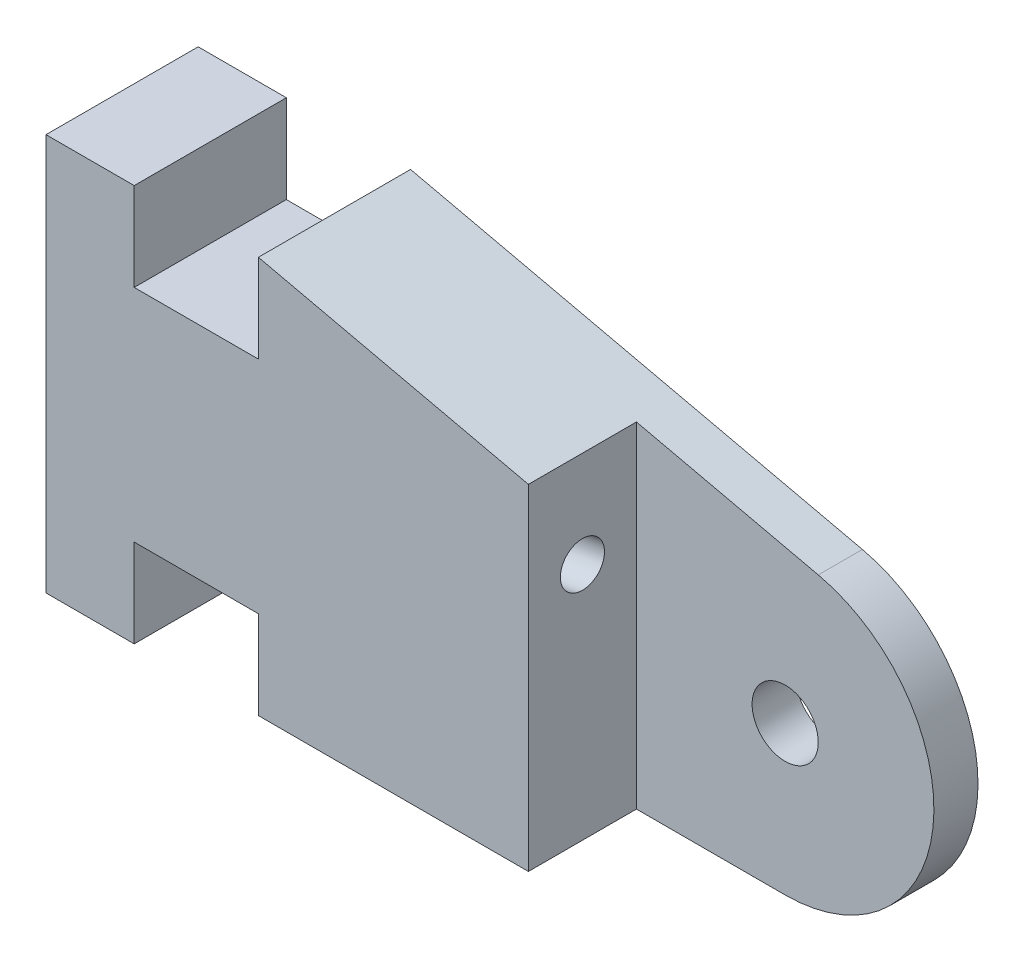
ISO-10303-21;
HEADER;
FILE_DESCRIPTION(('STEP AP214'),'2;1');
FILE_NAME('part.step','',(''),(''),'','','');
FILE_SCHEMA(('AUTOMOTIVE_DESIGN { 1 0 10303 214 1 1 1 1 }'));
ENDSEC;
DATA;
#1=APPLICATION_CONTEXT('core data for automotive mechanical design processes');
#2=APPLICATION_PROTOCOL_DEFINITION('international standard','automotive_design',2000,#1);
#3=PRODUCT_CONTEXT('',#1,'mechanical');
#4=PRODUCT('Part','Part','',(#3));
#5=PRODUCT_RELATED_PRODUCT_CATEGORY('part','',(#4));
#6=PRODUCT_DEFINITION_FORMATION('','',#4);
#7=PRODUCT_DEFINITION_CONTEXT('part definition',#1,'design');
#8=PRODUCT_DEFINITION('design','',#6,#7);
#9=PRODUCT_DEFINITION_SHAPE('','',#8);
#10=(LENGTH_UNIT() NAMED_UNIT(*) SI_UNIT(.MILLI.,.METRE.));
#11=(NAMED_UNIT(*) PLANE_ANGLE_UNIT() SI_UNIT($,.RADIAN.));
#12=(NAMED_UNIT(*) SI_UNIT($,.STERADIAN.) SOLID_ANGLE_UNIT());
#13=UNCERTAINTY_MEASURE_WITH_UNIT(LENGTH_MEASURE(1.E-05),#10,'distance_accuracy_value','');
#14=(GEOMETRIC_REPRESENTATION_CONTEXT(3) GLOBAL_UNCERTAINTY_ASSIGNED_CONTEXT((#13)) GLOBAL_UNIT_ASSIGNED_CONTEXT((#10,
#11,#12)) REPRESENTATION_CONTEXT('',''));
#15=CARTESIAN_POINT('',(0.,0.,0.));
#16=DIRECTION('',(0.,0.,1.));
#17=DIRECTION('',(1.,0.,0.));
#18=AXIS2_PLACEMENT_3D('',#15,#16,#17);
#19=CARTESIAN_POINT('',(21.8764722064192,0.,2.));
#20=DIRECTION('',(-1.,0.,0.));
#21=DIRECTION('',(0.,0.,1.));
#22=AXIS2_PLACEMENT_3D('',#19,#20,#21);
#23=PLANE('',#22);
#24=DIRECTION('',(0.,-1.,0.));
#25=VECTOR('',#24,1.);
#26=CARTESIAN_POINT('',(21.8764722064192,0.,6.9));
#27=LINE('',#26,#25);
#28=CARTESIAN_POINT('',(21.8764722064192,15.2040470613962,6.9));
#29=VERTEX_POINT('',#28);
#30=CARTESIAN_POINT('',(21.8764722064192,0.,6.9));
#31=VERTEX_POINT('',#30);
#32=EDGE_CURVE('E166',#29,#31,#27,.T.);
#33=ORIENTED_EDGE('',*,*,#32,.T.);
#34=DIRECTION('',(0.,0.,1.));
#35=VECTOR('',#34,1.);
#36=CARTESIAN_POINT('',(21.8764722064192,0.,2.));
#37=LINE('',#36,#35);
#38=CARTESIAN_POINT('',(21.8764722064192,0.,2.));
#39=VERTEX_POINT('',#38);
#40=EDGE_CURVE('E179',#39,#31,#37,.T.);
#41=ORIENTED_EDGE('',*,*,#40,.F.);
#42=DIRECTION('',(0.,-1.,0.));
#43=VECTOR('',#42,1.);
#44=CARTESIAN_POINT('',(21.8764722064192,0.,2.));
#45=LINE('',#44,#43);
#46=CARTESIAN_POINT('',(21.8764722064192,15.2040470613962,2.));
#47=VERTEX_POINT('',#46);
#48=EDGE_CURVE('E171',#47,#39,#45,.T.);
#49=ORIENTED_EDGE('',*,*,#48,.F.);
#50=DIRECTION('',(0.,0.,1.));
#51=VECTOR('',#50,1.);
#52=CARTESIAN_POINT('',(21.8764722064192,15.2040470613962,2.));
#53=LINE('',#52,#51);
#54=EDGE_CURVE('E177',#47,#29,#53,.T.);
#55=ORIENTED_EDGE('',*,*,#54,.T.);
#56=EDGE_LOOP('',(#33,#41,#49,#55));
#57=FACE_BOUND('',#56,.T.);
#58=CARTESIAN_POINT('',(21.8764722064192,10.8333931163656,4.45));
#59=DIRECTION('',(-1.,0.,0.));
#60=DIRECTION('',(0.,1.,0.));
#61=AXIS2_PLACEMENT_3D('',#58,#59,#60);
#62=ELLIPSE('',#61,1.01542661188575,1.);
#63=CARTESIAN_POINT('',(21.8764722064192,11.8488197282514,4.45));
#64=VERTEX_POINT('',#63);
#65=EDGE_CURVE('E160',#64,#64,#62,.F.);
#66=ORIENTED_EDGE('',*,*,#65,.F.);
#67=EDGE_LOOP('',(#66));
#68=FACE_BOUND('',#67,.T.);
#69=ADVANCED_FACE('F33',(#57,#68),#23,.F.);
#70=CARTESIAN_POINT('',(7.,8.,4.45));
#71=DIRECTION('',(-1.,0.,0.));
#72=DIRECTION('',(0.,-1.,0.));
#73=AXIS2_PLACEMENT_3D('',#70,#71,#72);
#74=CYLINDRICAL_SURFACE('',#73,1.);
#75=CARTESIAN_POINT('',(0.,8.,4.45));
#76=DIRECTION('',(-1.,0.,0.));
#77=DIRECTION('',(0.,-1.,0.));
#78=AXIS2_PLACEMENT_3D('',#75,#76,#77);
#79=CIRCLE('',#78,1.);
#80=CARTESIAN_POINT('',(0.,7.,4.45));
#81=VERTEX_POINT('',#80);
#82=EDGE_CURVE('E162',#81,#81,#79,.T.);
#83=ORIENTED_EDGE('',*,*,#82,.T.);
#84=EDGE_LOOP('',(#83));
#85=FACE_BOUND('',#84,.T.);
#86=CARTESIAN_POINT('',(5.8075013377449,8.,4.45));
#87=DIRECTION('',(-0.0871557427476594,0.996194698091746,0.));
#88=DIRECTION('',(-0.996194698091746,-0.0871557427476589,0.));
#89=AXIS2_PLACEMENT_3D('',#86,#87,#88);
#90=ELLIPSE('',#89,11.4737132456698,1.);
#91=CARTESIAN_POINT('',(6.821215844022,8.0886885273511,3.45394059157282));
#92=VERTEX_POINT('',#91);
#93=CARTESIAN_POINT('',(7.,8.10433011421715,3.45545727730407));
#94=VERTEX_POINT('',#93);
#95=EDGE_CURVE('E48',#92,#94,#90,.F.);
#96=ORIENTED_EDGE('',*,*,#95,.F.);
#97=CARTESIAN_POINT('',(6.8368540242733,8.,4.45));
#98=DIRECTION('',(-0.984807753012208,-0.173648177666931,0.));
#99=DIRECTION('',(-0.173648177666931,0.984807753012208,0.));
#100=AXIS2_PLACEMENT_3D('',#97,#98,#99);
#101=ELLIPSE('',#100,1.01542661188575,1.);
#102=CARTESIAN_POINT('',(6.821215844022,8.0886885273511,5.44605940842718));
#103=VERTEX_POINT('',#102);
#104=EDGE_CURVE('E11',#92,#103,#101,.F.);
#105=ORIENTED_EDGE('',*,*,#104,.T.);
#106=CARTESIAN_POINT('',(7.,8.10433011421715,5.44454272269593));
#107=VERTEX_POINT('',#106);
#108=EDGE_CURVE('E146',#107,#103,#90,.F.);
#109=ORIENTED_EDGE('',*,*,#108,.F.);
#110=CARTESIAN_POINT('',(7.,8.,4.45));
#111=DIRECTION('',(-1.,0.,0.));
#112=DIRECTION('',(0.,-1.,0.));
#113=AXIS2_PLACEMENT_3D('',#110,#111,#112);
#114=CIRCLE('',#113,1.);
#115=EDGE_CURVE('E159',#94,#107,#114,.T.);
#116=ORIENTED_EDGE('',*,*,#115,.F.);
#117=EDGE_LOOP('',(#96,#105,#109,#116));
#118=FACE_BOUND('',#117,.T.);
#119=ADVANCED_FACE('F158',(#85,#118),#74,.F.);
#120=CARTESIAN_POINT('',(7.,8.,4.45));
#121=DIRECTION('',(-1.,0.,0.));
#122=DIRECTION('',(0.,-1.,0.));
#123=AXIS2_PLACEMENT_3D('',#120,#121,#122);
#124=PLANE('',#123);
#125=ORIENTED_EDGE('',*,*,#115,.T.);
#126=CARTESIAN_POINT('',(7.,8.21026968861433,4.45));
#127=DIRECTION('',(-1.,0.,0.));
#128=DIRECTION('',(0.,1.,0.));
#129=AXIS2_PLACEMENT_3D('',#126,#127,#128);
#130=ELLIPSE('',#129,1.01542661188575,1.);
#131=EDGE_CURVE('E41',#107,#94,#130,.F.);
#132=ORIENTED_EDGE('',*,*,#131,.T.);
#133=EDGE_LOOP('',(#125,#132));
#134=FACE_BOUND('',#133,.T.);
#135=ADVANCED_FACE('F274',(#134),#124,.T.);
#136=CARTESIAN_POINT('',(28.6215163494173,6.74504414299814,6.9));
#137=DIRECTION('',(0.,0.,-1.));
#138=DIRECTION('',(-1.,0.,0.));
#139=AXIS2_PLACEMENT_3D('',#136,#137,#138);
#140=CYLINDRICAL_SURFACE('',#139,6.74504414299814);
#141=CARTESIAN_POINT('',(28.6215163494173,6.74504414299814,2.));
#142=DIRECTION('',(0.,0.,1.));
#143=DIRECTION('',(1.,0.,0.));
#144=AXIS2_PLACEMENT_3D('',#141,#142,#143);
#145=CIRCLE('',#144,6.74504414299814);
#146=CARTESIAN_POINT('',(28.6215163494173,0.,2.));
#147=VERTEX_POINT('',#146);
#148=CARTESIAN_POINT('',(30.1231764912827,13.3208054912624,2.));
#149=VERTEX_POINT('',#148);
#150=EDGE_CURVE('E56',#147,#149,#145,.T.);
#151=ORIENTED_EDGE('',*,*,#150,.F.);
#152=DIRECTION('',(0.,0.,-1.));
#153=VECTOR('',#152,1.);
#154=CARTESIAN_POINT('',(28.6215163494173,0.,6.9));
#155=LINE('',#154,#153);
#156=CARTESIAN_POINT('',(28.6215163494173,0.,0.));
#157=VERTEX_POINT('',#156);
#158=EDGE_CURVE('E243',#147,#157,#155,.T.);
#159=ORIENTED_EDGE('',*,*,#158,.T.);
#160=CARTESIAN_POINT('',(28.6215163494173,6.74504414299814,0.));
#161=DIRECTION('',(0.,0.,1.));
#162=DIRECTION('',(1.,0.,0.));
#163=AXIS2_PLACEMENT_3D('',#160,#161,#162);
#164=CIRCLE('',#163,6.74504414299814);
#165=CARTESIAN_POINT('',(30.1231764912827,13.3208054912624,0.));
#166=VERTEX_POINT('',#165);
#167=EDGE_CURVE('E235',#157,#166,#164,.T.);
#168=ORIENTED_EDGE('',*,*,#167,.T.);
#169=DIRECTION('',(0.,0.,-1.));
#170=VECTOR('',#169,1.);
#171=CARTESIAN_POINT('',(30.1231764912827,13.3208054912624,6.9));
#172=LINE('',#171,#170);
#173=EDGE_CURVE('E241',#149,#166,#172,.T.);
#174=ORIENTED_EDGE('',*,*,#173,.F.);
#175=EDGE_LOOP('',(#151,#159,#168,#174));
#176=FACE_BOUND('',#175,.T.);
#177=ADVANCED_FACE('F276',(#176),#140,.T.);
#178=CARTESIAN_POINT('',(28.6215163494173,6.74504414299814,6.9));
#179=DIRECTION('',(0.,0.,-1.));
#180=DIRECTION('',(-1.,0.,0.));
#181=AXIS2_PLACEMENT_3D('',#178,#179,#180);
#182=CYLINDRICAL_SURFACE('',#181,1.49999999999871);
#183=CARTESIAN_POINT('',(28.6215163494173,6.74504414299814,0.));
#184=DIRECTION('',(0.,0.,1.));
#185=DIRECTION('',(1.,0.,0.));
#186=AXIS2_PLACEMENT_3D('',#183,#184,#185);
#187=CIRCLE('',#186,1.49999999999871);
#188=CARTESIAN_POINT('',(30.121516349416,6.74504414299814,0.));
#189=VERTEX_POINT('',#188);
#190=EDGE_CURVE('E184',#189,#189,#187,.T.);
#191=ORIENTED_EDGE('',*,*,#190,.F.);
#192=EDGE_LOOP('',(#191));
#193=FACE_BOUND('',#192,.T.);
#194=CARTESIAN_POINT('',(28.6215163494173,6.74504414299814,2.));
#195=DIRECTION('',(0.,0.,1.));
#196=DIRECTION('',(1.,0.,0.));
#197=AXIS2_PLACEMENT_3D('',#194,#195,#196);
#198=CIRCLE('',#197,1.49999999999871);
#199=CARTESIAN_POINT('',(30.121516349416,6.74504414299814,2.));
#200=VERTEX_POINT('',#199);
#201=EDGE_CURVE('E182',#200,#200,#198,.T.);
#202=ORIENTED_EDGE('',*,*,#201,.T.);
#203=EDGE_LOOP('',(#202));
#204=FACE_BOUND('',#203,.T.);
#205=ADVANCED_FACE('F282',(#193,#204),#182,.F.);
#206=CARTESIAN_POINT('',(28.6215163494173,6.74504414299814,6.9));
#207=DIRECTION('',(0.,0.,1.));
#208=DIRECTION('',(1.,0.,0.));
#209=AXIS2_PLACEMENT_3D('',#206,#207,#208);
#210=PLANE('',#209);
#211=ORIENTED_EDGE('',*,*,#32,.F.);
#212=DIRECTION('',(-0.974902640939778,0.222631625535649,0.));
#213=VECTOR('',#212,1.);
#214=CARTESIAN_POINT('',(9.63151634941732,18.0003410835651,6.9));
#215=LINE('',#214,#213);
#216=CARTESIAN_POINT('',(9.63151634941732,18.0003410835651,6.9));
#217=VERTEX_POINT('',#216);
#218=EDGE_CURVE('E211',#29,#217,#215,.T.);
#219=ORIENTED_EDGE('',*,*,#218,.T.);
#220=DIRECTION('',(0.,-1.,0.));
#221=VECTOR('',#220,1.);
#222=CARTESIAN_POINT('',(9.63151634941732,18.0003410835651,6.9));
#223=LINE('',#222,#221);
#224=CARTESIAN_POINT('',(9.63151634941733,14.0003410835651,6.9));
#225=VERTEX_POINT('',#224);
#226=EDGE_CURVE('E188',#217,#225,#223,.T.);
#227=ORIENTED_EDGE('',*,*,#226,.T.);
#228=DIRECTION('',(-1.,0.,0.));
#229=VECTOR('',#228,1.);
#230=CARTESIAN_POINT('',(9.63151634941733,14.0003410835651,6.9));
#231=LINE('',#230,#229);
#232=CARTESIAN_POINT('',(4.,14.0003410835651,6.9));
#233=VERTEX_POINT('',#232);
#234=EDGE_CURVE('E191',#225,#233,#231,.T.);
#235=ORIENTED_EDGE('',*,*,#234,.T.);
#236=DIRECTION('',(0.,1.,0.));
#237=VECTOR('',#236,1.);
#238=CARTESIAN_POINT('',(4.,18.0003410835651,6.9));
#239=LINE('',#238,#237);
#240=CARTESIAN_POINT('',(4.,18.0003410835651,6.9));
#241=VERTEX_POINT('',#240);
#242=EDGE_CURVE('E194',#233,#241,#239,.T.);
#243=ORIENTED_EDGE('',*,*,#242,.T.);
#244=DIRECTION('',(-1.,0.,0.));
#245=VECTOR('',#244,1.);
#246=CARTESIAN_POINT('',(0.,18.0003410835651,6.9));
#247=LINE('',#246,#245);
#248=CARTESIAN_POINT('',(0.,18.0003410835651,6.9));
#249=VERTEX_POINT('',#248);
#250=EDGE_CURVE('E196',#241,#249,#247,.T.);
#251=ORIENTED_EDGE('',*,*,#250,.T.);
#252=DIRECTION('',(0.,-1.,0.));
#253=VECTOR('',#252,1.);
#254=CARTESIAN_POINT('',(0.,0.,6.9));
#255=LINE('',#254,#253);
#256=CARTESIAN_POINT('',(0.,0.,6.9));
#257=VERTEX_POINT('',#256);
#258=EDGE_CURVE('E198',#249,#257,#255,.T.);
#259=ORIENTED_EDGE('',*,*,#258,.T.);
#260=DIRECTION('',(1.,0.,0.));
#261=VECTOR('',#260,1.);
#262=CARTESIAN_POINT('',(0.,0.,6.9));
#263=LINE('',#262,#261);
#264=CARTESIAN_POINT('',(4.,0.,6.9));
#265=VERTEX_POINT('',#264);
#266=EDGE_CURVE('E200',#257,#265,#263,.T.);
#267=ORIENTED_EDGE('',*,*,#266,.T.);
#268=DIRECTION('',(0.,1.,0.));
#269=VECTOR('',#268,1.);
#270=CARTESIAN_POINT('',(4.,0.,6.9));
#271=LINE('',#270,#269);
#272=CARTESIAN_POINT('',(4.,4.,6.9));
#273=VERTEX_POINT('',#272);
#274=EDGE_CURVE('E202',#265,#273,#271,.T.);
#275=ORIENTED_EDGE('',*,*,#274,.T.);
#276=DIRECTION('',(1.,0.,0.));
#277=VECTOR('',#276,1.);
#278=CARTESIAN_POINT('',(9.63151634941733,4.,6.9));
#279=LINE('',#278,#277);
#280=CARTESIAN_POINT('',(9.63151634941733,4.,6.9));
#281=VERTEX_POINT('',#280);
#282=EDGE_CURVE('E204',#273,#281,#279,.T.);
#283=ORIENTED_EDGE('',*,*,#282,.T.);
#284=DIRECTION('',(0.,-1.,0.));
#285=VECTOR('',#284,1.);
#286=CARTESIAN_POINT('',(9.63151634941733,0.,6.9));
#287=LINE('',#286,#285);
#288=CARTESIAN_POINT('',(9.63151634941733,0.,6.9));
#289=VERTEX_POINT('',#288);
#290=EDGE_CURVE('E206',#281,#289,#287,.T.);
#291=ORIENTED_EDGE('',*,*,#290,.T.);
#292=DIRECTION('',(1.,0.,0.));
#293=VECTOR('',#292,1.);
#294=CARTESIAN_POINT('',(9.63151634941733,0.,6.9));
#295=LINE('',#294,#293);
#296=EDGE_CURVE('E208',#289,#31,#295,.T.);
#297=ORIENTED_EDGE('',*,*,#296,.T.);
#298=EDGE_LOOP('',(#211,#219,#227,#235,#243,#251,#259,#267,#275,#283,#291,#297));
#299=FACE_BOUND('',#298,.T.);
#300=ADVANCED_FACE('F299',(#299),#210,.T.);
#301=CARTESIAN_POINT('',(28.6215163494173,6.74504414299814,0.));
#302=DIRECTION('',(0.,0.,1.));
#303=DIRECTION('',(1.,0.,0.));
#304=AXIS2_PLACEMENT_3D('',#301,#302,#303);
#305=PLANE('',#304);
#306=DIRECTION('',(0.,-1.,0.));
#307=VECTOR('',#306,1.);
#308=CARTESIAN_POINT('',(9.63151634941732,18.0003410835651,0.));
#309=LINE('',#308,#307);
#310=CARTESIAN_POINT('',(9.63151634941732,18.0003410835651,0.));
#311=VERTEX_POINT('',#310);
#312=CARTESIAN_POINT('',(9.63151634941733,14.0003410835651,0.));
#313=VERTEX_POINT('',#312);
#314=EDGE_CURVE('E187',#311,#313,#309,.T.);
#315=ORIENTED_EDGE('',*,*,#314,.F.);
#316=DIRECTION('',(-0.974902640939778,0.222631625535649,0.));
#317=VECTOR('',#316,1.);
#318=CARTESIAN_POINT('',(9.63151634941732,18.0003410835651,0.));
#319=LINE('',#318,#317);
#320=EDGE_CURVE('E192',#166,#311,#319,.T.);
#321=ORIENTED_EDGE('',*,*,#320,.F.);
#322=ORIENTED_EDGE('',*,*,#167,.F.);
#323=DIRECTION('',(1.,0.,0.));
#324=VECTOR('',#323,1.);
#325=CARTESIAN_POINT('',(9.63151634941733,0.,0.));
#326=LINE('',#325,#324);
#327=CARTESIAN_POINT('',(9.63151634941733,0.,0.));
#328=VERTEX_POINT('',#327);
#329=EDGE_CURVE('E232',#328,#157,#326,.T.);
#330=ORIENTED_EDGE('',*,*,#329,.F.);
#331=DIRECTION('',(0.,-1.,0.));
#332=VECTOR('',#331,1.);
#333=CARTESIAN_POINT('',(9.63151634941733,0.,0.));
#334=LINE('',#333,#332);
#335=CARTESIAN_POINT('',(9.63151634941733,4.,0.));
#336=VERTEX_POINT('',#335);
#337=EDGE_CURVE('E230',#336,#328,#334,.T.);
#338=ORIENTED_EDGE('',*,*,#337,.F.);
#339=DIRECTION('',(1.,0.,0.));
#340=VECTOR('',#339,1.);
#341=CARTESIAN_POINT('',(9.63151634941733,4.,0.));
#342=LINE('',#341,#340);
#343=CARTESIAN_POINT('',(4.,4.,0.));
#344=VERTEX_POINT('',#343);
#345=EDGE_CURVE('E228',#344,#336,#342,.T.);
#346=ORIENTED_EDGE('',*,*,#345,.F.);
#347=DIRECTION('',(0.,1.,0.));
#348=VECTOR('',#347,1.);
#349=CARTESIAN_POINT('',(4.,0.,0.));
#350=LINE('',#349,#348);
#351=CARTESIAN_POINT('',(4.,0.,0.));
#352=VERTEX_POINT('',#351);
#353=EDGE_CURVE('E226',#352,#344,#350,.T.);
#354=ORIENTED_EDGE('',*,*,#353,.F.);
#355=DIRECTION('',(1.,0.,0.));
#356=VECTOR('',#355,1.);
#357=CARTESIAN_POINT('',(0.,0.,0.));
#358=LINE('',#357,#356);
#359=CARTESIAN_POINT('',(0.,0.,0.));
#360=VERTEX_POINT('',#359);
#361=EDGE_CURVE('E224',#360,#352,#358,.T.);
#362=ORIENTED_EDGE('',*,*,#361,.F.);
#363=DIRECTION('',(0.,-1.,0.));
#364=VECTOR('',#363,1.);
#365=CARTESIAN_POINT('',(0.,0.,0.));
#366=LINE('',#365,#364);
#367=CARTESIAN_POINT('',(0.,18.0003410835651,0.));
#368=VERTEX_POINT('',#367);
#369=EDGE_CURVE('E222',#368,#360,#366,.T.);
#370=ORIENTED_EDGE('',*,*,#369,.F.);
#371=DIRECTION('',(-1.,0.,0.));
#372=VECTOR('',#371,1.);
#373=CARTESIAN_POINT('',(0.,18.0003410835651,0.));
#374=LINE('',#373,#372);
#375=CARTESIAN_POINT('',(4.,18.0003410835651,0.));
#376=VERTEX_POINT('',#375);
#377=EDGE_CURVE('E220',#376,#368,#374,.T.);
#378=ORIENTED_EDGE('',*,*,#377,.F.);
#379=DIRECTION('',(0.,1.,0.));
#380=VECTOR('',#379,1.);
#381=CARTESIAN_POINT('',(4.,18.0003410835651,0.));
#382=LINE('',#381,#380);
#383=CARTESIAN_POINT('',(4.,14.0003410835651,0.));
#384=VERTEX_POINT('',#383);
#385=EDGE_CURVE('E218',#384,#376,#382,.T.);
#386=ORIENTED_EDGE('',*,*,#385,.F.);
#387=DIRECTION('',(-1.,0.,0.));
#388=VECTOR('',#387,1.);
#389=CARTESIAN_POINT('',(9.63151634941733,14.0003410835651,0.));
#390=LINE('',#389,#388);
#391=EDGE_CURVE('E216',#313,#384,#390,.T.);
#392=ORIENTED_EDGE('',*,*,#391,.F.);
#393=EDGE_LOOP('',(#315,#321,#322,#330,#338,#346,#354,#362,#370,#378,#386,#392));
#394=FACE_BOUND('',#393,.T.);
#395=ORIENTED_EDGE('',*,*,#190,.T.);
#396=EDGE_LOOP('',(#395));
#397=FACE_BOUND('',#396,.T.);
#398=ADVANCED_FACE('F303',(#394,#397),#305,.F.);
#399=CARTESIAN_POINT('',(9.63151634941732,18.0003410835651,6.9));
#400=DIRECTION('',(1.,0.,0.));
#401=DIRECTION('',(0.,1.,0.));
#402=AXIS2_PLACEMENT_3D('',#399,#400,#401);
#403=PLANE('',#402);
#404=ORIENTED_EDGE('',*,*,#314,.T.);
#405=DIRECTION('',(0.,0.,-1.));
#406=VECTOR('',#405,1.);
#407=CARTESIAN_POINT('',(9.63151634941733,14.0003410835651,6.9));
#408=LINE('',#407,#406);
#409=EDGE_CURVE('E269',#225,#313,#408,.T.);
#410=ORIENTED_EDGE('',*,*,#409,.F.);
#411=ORIENTED_EDGE('',*,*,#226,.F.);
#412=DIRECTION('',(0.,0.,-1.));
#413=VECTOR('',#412,1.);
#414=CARTESIAN_POINT('',(9.63151634941732,18.0003410835651,6.9));
#415=LINE('',#414,#413);
#416=EDGE_CURVE('E213',#217,#311,#415,.T.);
#417=ORIENTED_EDGE('',*,*,#416,.T.);
#418=EDGE_LOOP('',(#404,#410,#411,#417));
#419=FACE_BOUND('',#418,.T.);
#420=ADVANCED_FACE('F35',(#419),#403,.F.);
#421=CARTESIAN_POINT('',(9.63151634941733,14.0003410835651,6.9));
#422=DIRECTION('',(0.,-1.,0.));
#423=DIRECTION('',(1.,0.,0.));
#424=AXIS2_PLACEMENT_3D('',#421,#422,#423);
#425=PLANE('',#424);
#426=ORIENTED_EDGE('',*,*,#391,.T.);
#427=DIRECTION('',(0.,0.,-1.));
#428=VECTOR('',#427,1.);
#429=CARTESIAN_POINT('',(4.,14.0003410835651,6.9));
#430=LINE('',#429,#428);
#431=EDGE_CURVE('E266',#233,#384,#430,.T.);
#432=ORIENTED_EDGE('',*,*,#431,.F.);
#433=ORIENTED_EDGE('',*,*,#234,.F.);
#434=ORIENTED_EDGE('',*,*,#409,.T.);
#435=EDGE_LOOP('',(#426,#432,#433,#434));
#436=FACE_BOUND('',#435,.T.);
#437=ADVANCED_FACE('F342',(#436),#425,.F.);
#438=CARTESIAN_POINT('',(4.,18.0003410835651,6.9));
#439=DIRECTION('',(-1.,0.,0.));
#440=DIRECTION('',(0.,-1.,0.));
#441=AXIS2_PLACEMENT_3D('',#438,#439,#440);
#442=PLANE('',#441);
#443=ORIENTED_EDGE('',*,*,#385,.T.);
#444=DIRECTION('',(0.,0.,-1.));
#445=VECTOR('',#444,1.);
#446=CARTESIAN_POINT('',(4.,18.0003410835651,6.9));
#447=LINE('',#446,#445);
#448=EDGE_CURVE('E263',#241,#376,#447,.T.);
#449=ORIENTED_EDGE('',*,*,#448,.F.);
#450=ORIENTED_EDGE('',*,*,#242,.F.);
#451=ORIENTED_EDGE('',*,*,#431,.T.);
#452=EDGE_LOOP('',(#443,#449,#450,#451));
#453=FACE_BOUND('',#452,.T.);
#454=ADVANCED_FACE('F339',(#453),#442,.F.);
#455=CARTESIAN_POINT('',(0.,18.0003410835651,6.9));
#456=DIRECTION('',(0.,-1.,0.));
#457=DIRECTION('',(0.,0.,-1.));
#458=AXIS2_PLACEMENT_3D('',#455,#456,#457);
#459=PLANE('',#458);
#460=ORIENTED_EDGE('',*,*,#377,.T.);
#461=DIRECTION('',(0.,0.,-1.));
#462=VECTOR('',#461,1.);
#463=CARTESIAN_POINT('',(0.,18.0003410835651,6.9));
#464=LINE('',#463,#462);
#465=EDGE_CURVE('E260',#249,#368,#464,.T.);
#466=ORIENTED_EDGE('',*,*,#465,.F.);
#467=ORIENTED_EDGE('',*,*,#250,.F.);
#468=ORIENTED_EDGE('',*,*,#448,.T.);
#469=EDGE_LOOP('',(#460,#466,#467,#468));
#470=FACE_BOUND('',#469,.T.);
#471=ADVANCED_FACE('F335',(#470),#459,.F.);
#472=CARTESIAN_POINT('',(0.,0.,6.9));
#473=DIRECTION('',(1.,0.,0.));
#474=DIRECTION('',(0.,1.,0.));
#475=AXIS2_PLACEMENT_3D('',#472,#473,#474);
#476=PLANE('',#475);
#477=ORIENTED_EDGE('',*,*,#82,.F.);
#478=EDGE_LOOP('',(#477));
#479=FACE_BOUND('',#478,.T.);
#480=ORIENTED_EDGE('',*,*,#369,.T.);
#481=DIRECTION('',(0.,0.,-1.));
#482=VECTOR('',#481,1.);
#483=CARTESIAN_POINT('',(0.,0.,6.9));
#484=LINE('',#483,#482);
#485=EDGE_CURVE('E257',#257,#360,#484,.T.);
#486=ORIENTED_EDGE('',*,*,#485,.F.);
#487=ORIENTED_EDGE('',*,*,#258,.F.);
#488=ORIENTED_EDGE('',*,*,#465,.T.);
#489=EDGE_LOOP('',(#480,#486,#487,#488));
#490=FACE_BOUND('',#489,.T.);
#491=ADVANCED_FACE('F331',(#479,#490),#476,.F.);
#492=CARTESIAN_POINT('',(0.,0.,6.9));
#493=DIRECTION('',(0.,1.,0.));
#494=DIRECTION('',(0.,0.,1.));
#495=AXIS2_PLACEMENT_3D('',#492,#493,#494);
#496=PLANE('',#495);
#497=ORIENTED_EDGE('',*,*,#361,.T.);
#498=DIRECTION('',(0.,0.,-1.));
#499=VECTOR('',#498,1.);
#500=CARTESIAN_POINT('',(4.,0.,6.9));
#501=LINE('',#500,#499);
#502=EDGE_CURVE('E254',#265,#352,#501,.T.);
#503=ORIENTED_EDGE('',*,*,#502,.F.);
#504=ORIENTED_EDGE('',*,*,#266,.F.);
#505=ORIENTED_EDGE('',*,*,#485,.T.);
#506=EDGE_LOOP('',(#497,#503,#504,#505));
#507=FACE_BOUND('',#506,.T.);
#508=ADVANCED_FACE('F327',(#507),#496,.F.);
#509=CARTESIAN_POINT('',(4.,0.,6.9));
#510=DIRECTION('',(-1.,0.,0.));
#511=DIRECTION('',(0.,0.,1.));
#512=AXIS2_PLACEMENT_3D('',#509,#510,#511);
#513=PLANE('',#512);
#514=ORIENTED_EDGE('',*,*,#353,.T.);
#515=DIRECTION('',(0.,0.,-1.));
#516=VECTOR('',#515,1.);
#517=CARTESIAN_POINT('',(4.,4.,6.9));
#518=LINE('',#517,#516);
#519=EDGE_CURVE('E251',#273,#344,#518,.T.);
#520=ORIENTED_EDGE('',*,*,#519,.F.);
#521=ORIENTED_EDGE('',*,*,#274,.F.);
#522=ORIENTED_EDGE('',*,*,#502,.T.);
#523=EDGE_LOOP('',(#514,#520,#521,#522));
#524=FACE_BOUND('',#523,.T.);
#525=ADVANCED_FACE('F323',(#524),#513,.F.);
#526=CARTESIAN_POINT('',(9.63151634941733,4.,6.9));
#527=DIRECTION('',(0.,1.,0.));
#528=DIRECTION('',(-1.,0.,0.));
#529=AXIS2_PLACEMENT_3D('',#526,#527,#528);
#530=PLANE('',#529);
#531=ORIENTED_EDGE('',*,*,#345,.T.);
#532=DIRECTION('',(0.,0.,-1.));
#533=VECTOR('',#532,1.);
#534=CARTESIAN_POINT('',(9.63151634941733,4.,6.9));
#535=LINE('',#534,#533);
#536=EDGE_CURVE('E248',#281,#336,#535,.T.);
#537=ORIENTED_EDGE('',*,*,#536,.F.);
#538=ORIENTED_EDGE('',*,*,#282,.F.);
#539=ORIENTED_EDGE('',*,*,#519,.T.);
#540=EDGE_LOOP('',(#531,#537,#538,#539));
#541=FACE_BOUND('',#540,.T.);
#542=ADVANCED_FACE('F319',(#541),#530,.F.);
#543=CARTESIAN_POINT('',(9.63151634941733,0.,6.9));
#544=DIRECTION('',(1.,0.,0.));
#545=DIRECTION('',(0.,0.,-1.));
#546=AXIS2_PLACEMENT_3D('',#543,#544,#545);
#547=PLANE('',#546);
#548=ORIENTED_EDGE('',*,*,#337,.T.);
#549=DIRECTION('',(0.,0.,-1.));
#550=VECTOR('',#549,1.);
#551=CARTESIAN_POINT('',(9.63151634941733,0.,6.9));
#552=LINE('',#551,#550);
#553=EDGE_CURVE('E245',#289,#328,#552,.T.);
#554=ORIENTED_EDGE('',*,*,#553,.F.);
#555=ORIENTED_EDGE('',*,*,#290,.F.);
#556=ORIENTED_EDGE('',*,*,#536,.T.);
#557=EDGE_LOOP('',(#548,#554,#555,#556));
#558=FACE_BOUND('',#557,.T.);
#559=ADVANCED_FACE('F315',(#558),#547,.F.);
#560=CARTESIAN_POINT('',(9.63151634941733,0.,6.9));
#561=DIRECTION('',(0.,1.,0.));
#562=DIRECTION('',(0.,0.,1.));
#563=AXIS2_PLACEMENT_3D('',#560,#561,#562);
#564=PLANE('',#563);
#565=DIRECTION('',(1.,0.,0.));
#566=VECTOR('',#565,1.);
#567=CARTESIAN_POINT('',(21.8764722064192,0.,2.));
#568=LINE('',#567,#566);
#569=EDGE_CURVE('E174',#39,#147,#568,.T.);
#570=ORIENTED_EDGE('',*,*,#569,.F.);
#571=ORIENTED_EDGE('',*,*,#40,.T.);
#572=ORIENTED_EDGE('',*,*,#296,.F.);
#573=ORIENTED_EDGE('',*,*,#553,.T.);
#574=ORIENTED_EDGE('',*,*,#329,.T.);
#575=ORIENTED_EDGE('',*,*,#158,.F.);
#576=EDGE_LOOP('',(#570,#571,#572,#573,#574,#575));
#577=FACE_BOUND('',#576,.T.);
#578=ADVANCED_FACE('F310',(#577),#564,.F.);
#579=CARTESIAN_POINT('',(9.63151634941732,18.0003410835651,6.9));
#580=DIRECTION('',(-0.222631625535649,-0.974902640939778,0.));
#581=DIRECTION('',(0.974902640939779,-0.222631625535649,0.));
#582=AXIS2_PLACEMENT_3D('',#579,#580,#581);
#583=PLANE('',#582);
#584=ORIENTED_EDGE('',*,*,#218,.F.);
#585=ORIENTED_EDGE('',*,*,#54,.F.);
#586=DIRECTION('',(-0.974902640939778,0.222631625535649,0.));
#587=VECTOR('',#586,1.);
#588=CARTESIAN_POINT('',(21.8764722064192,15.2040470613962,2.));
#589=LINE('',#588,#587);
#590=EDGE_CURVE('E169',#149,#47,#589,.T.);
#591=ORIENTED_EDGE('',*,*,#590,.F.);
#592=ORIENTED_EDGE('',*,*,#173,.T.);
#593=ORIENTED_EDGE('',*,*,#320,.T.);
#594=ORIENTED_EDGE('',*,*,#416,.F.);
#595=EDGE_LOOP('',(#584,#585,#591,#592,#593,#594));
#596=FACE_BOUND('',#595,.T.);
#597=ADVANCED_FACE('F308',(#596),#583,.F.);
#598=CARTESIAN_POINT('',(28.6215163494173,6.74504414299814,2.));
#599=DIRECTION('',(0.,0.,1.));
#600=DIRECTION('',(1.,0.,0.));
#601=AXIS2_PLACEMENT_3D('',#598,#599,#600);
#602=PLANE('',#601);
#603=ORIENTED_EDGE('',*,*,#201,.F.);
#604=EDGE_LOOP('',(#603));
#605=FACE_BOUND('',#604,.T.);
#606=ORIENTED_EDGE('',*,*,#590,.T.);
#607=ORIENTED_EDGE('',*,*,#48,.T.);
#608=ORIENTED_EDGE('',*,*,#569,.T.);
#609=ORIENTED_EDGE('',*,*,#150,.T.);
#610=EDGE_LOOP('',(#606,#607,#608,#609));
#611=FACE_BOUND('',#610,.T.);
#612=ADVANCED_FACE('F296',(#605,#611),#602,.T.);
#613=CARTESIAN_POINT('',(6.80581524286754,8.17602967668956,4.45));
#614=DIRECTION('',(-0.984807753012208,-0.173648177666931,0.));
#615=DIRECTION('',(0.173648177666931,-0.984807753012208,0.));
#616=AXIS2_PLACEMENT_3D('',#613,#614,#615);
#617=PLANE('',#616);
#618=CARTESIAN_POINT('',(6.80581524286754,8.17602967668956,4.45));
#619=DIRECTION('',(-0.984807753012208,-0.173648177666931,0.));
#620=DIRECTION('',(0.173648177666931,-0.984807753012208,0.));
#621=AXIS2_PLACEMENT_3D('',#618,#619,#620);
#622=CIRCLE('',#621,1.);
#623=EDGE_CURVE('E150',#103,#92,#622,.T.);
#624=ORIENTED_EDGE('',*,*,#623,.F.);
#625=ORIENTED_EDGE('',*,*,#104,.F.);
#626=EDGE_LOOP('',(#624,#625));
#627=FACE_BOUND('',#626,.T.);
#628=ADVANCED_FACE('F156',(#627),#617,.F.);
#629=CARTESIAN_POINT('',(6.80581524286754,8.17602967668956,4.45));
#630=DIRECTION('',(0.984807753012208,0.173648177666931,0.));
#631=DIRECTION('',(-0.173648177666931,0.984807753012208,0.));
#632=AXIS2_PLACEMENT_3D('',#629,#630,#631);
#633=CYLINDRICAL_SURFACE('',#632,1.);
#634=ORIENTED_EDGE('',*,*,#95,.T.);
#635=ORIENTED_EDGE('',*,*,#131,.F.);
#636=ORIENTED_EDGE('',*,*,#108,.T.);
#637=ORIENTED_EDGE('',*,*,#623,.T.);
#638=EDGE_LOOP('',(#634,#635,#636,#637));
#639=FACE_BOUND('',#638,.T.);
#640=ORIENTED_EDGE('',*,*,#65,.T.);
#641=EDGE_LOOP('',(#640));
#642=FACE_BOUND('',#641,.T.);
#643=ADVANCED_FACE('F148',(#639,#642),#633,.F.);
#644=CLOSED_SHELL('',(#69,#119,#135,#177,#205,#300,#398,#420,#437,#454,#471,#491,#508,#525,#542,
#559,#578,#597,#612,#628,#643));
#645=MANIFOLD_SOLID_BREP('B2',#644);
#646=ADVANCED_BREP_SHAPE_REPRESENTATION('',(#18,#645),#14);
#647=SHAPE_DEFINITION_REPRESENTATION(#9,#646);
ENDSEC;
END-ISO-10303-21;
